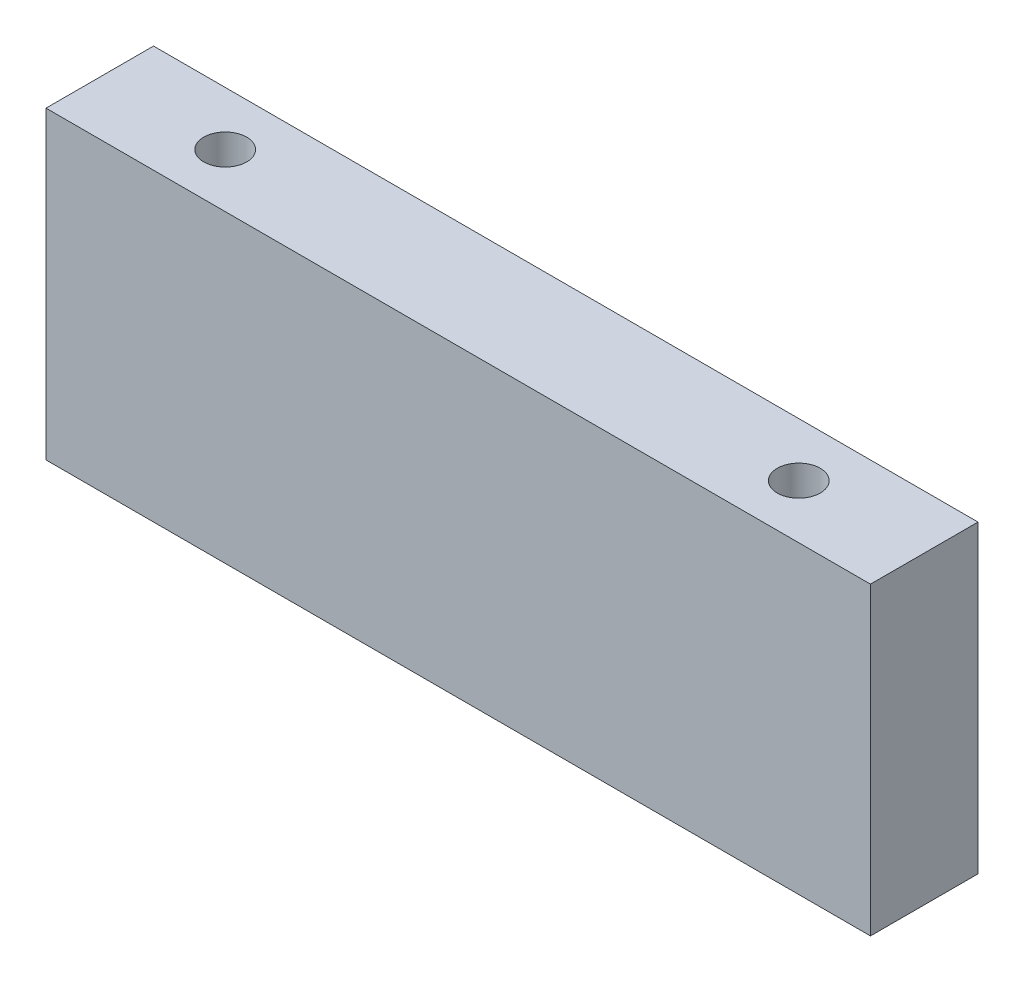
ISO-10303-21;
HEADER;
FILE_DESCRIPTION(('STEP AP214'),'2;1');
FILE_NAME('part.step','',(''),(''),'','','');
FILE_SCHEMA(('AUTOMOTIVE_DESIGN { 1 0 10303 214 1 1 1 1 }'));
ENDSEC;
DATA;
#1=APPLICATION_CONTEXT('core data for automotive mechanical design processes');
#2=APPLICATION_PROTOCOL_DEFINITION('international standard','automotive_design',2000,#1);
#3=PRODUCT_CONTEXT('',#1,'mechanical');
#4=PRODUCT('Part','Part','',(#3));
#5=PRODUCT_RELATED_PRODUCT_CATEGORY('part','',(#4));
#6=PRODUCT_DEFINITION_FORMATION('','',#4);
#7=PRODUCT_DEFINITION_CONTEXT('part definition',#1,'design');
#8=PRODUCT_DEFINITION('design','',#6,#7);
#9=PRODUCT_DEFINITION_SHAPE('','',#8);
#10=(LENGTH_UNIT() NAMED_UNIT(*) SI_UNIT(.MILLI.,.METRE.));
#11=(NAMED_UNIT(*) PLANE_ANGLE_UNIT() SI_UNIT($,.RADIAN.));
#12=(NAMED_UNIT(*) SI_UNIT($,.STERADIAN.) SOLID_ANGLE_UNIT());
#13=UNCERTAINTY_MEASURE_WITH_UNIT(LENGTH_MEASURE(1.E-05),#10,'distance_accuracy_value','');
#14=(GEOMETRIC_REPRESENTATION_CONTEXT(3) GLOBAL_UNCERTAINTY_ASSIGNED_CONTEXT((#13)) GLOBAL_UNIT_ASSIGNED_CONTEXT((#10,
#11,#12)) REPRESENTATION_CONTEXT('',''));
#15=CARTESIAN_POINT('',(0.,0.,0.));
#16=DIRECTION('',(0.,0.,1.));
#17=DIRECTION('',(1.,0.,0.));
#18=AXIS2_PLACEMENT_3D('',#15,#16,#17);
#19=CARTESIAN_POINT('',(57.5,42.5,7.5));
#20=DIRECTION('',(-1.,0.,0.));
#21=DIRECTION('',(0.,0.,1.));
#22=AXIS2_PLACEMENT_3D('',#19,#20,#21);
#23=PLANE('',#22);
#24=DIRECTION('',(0.,0.,-1.));
#25=VECTOR('',#24,1.);
#26=CARTESIAN_POINT('',(57.5,0.,7.5));
#27=LINE('',#26,#25);
#28=CARTESIAN_POINT('',(57.5,0.,7.5));
#29=VERTEX_POINT('',#28);
#30=CARTESIAN_POINT('',(57.5,0.,-7.5));
#31=VERTEX_POINT('',#30);
#32=EDGE_CURVE('E97',#29,#31,#27,.T.);
#33=ORIENTED_EDGE('',*,*,#32,.T.);
#34=DIRECTION('',(0.,-1.,0.));
#35=VECTOR('',#34,1.);
#36=CARTESIAN_POINT('',(57.5,42.5,-7.5));
#37=LINE('',#36,#35);
#38=CARTESIAN_POINT('',(57.5,42.5,-7.5));
#39=VERTEX_POINT('',#38);
#40=EDGE_CURVE('E11',#39,#31,#37,.T.);
#41=ORIENTED_EDGE('',*,*,#40,.F.);
#42=DIRECTION('',(0.,0.,-1.));
#43=VECTOR('',#42,1.);
#44=CARTESIAN_POINT('',(57.5,42.5,7.5));
#45=LINE('',#44,#43);
#46=CARTESIAN_POINT('',(57.5,42.5,7.5));
#47=VERTEX_POINT('',#46);
#48=EDGE_CURVE('E85',#47,#39,#45,.T.);
#49=ORIENTED_EDGE('',*,*,#48,.F.);
#50=DIRECTION('',(0.,-1.,0.));
#51=VECTOR('',#50,1.);
#52=CARTESIAN_POINT('',(57.5,42.5,7.5));
#53=LINE('',#52,#51);
#54=EDGE_CURVE('E93',#47,#29,#53,.T.);
#55=ORIENTED_EDGE('',*,*,#54,.T.);
#56=EDGE_LOOP('',(#33,#41,#49,#55));
#57=FACE_BOUND('',#56,.T.);
#58=ADVANCED_FACE('F34',(#57),#23,.F.);
#59=CARTESIAN_POINT('',(-57.5,42.5,-7.5));
#60=DIRECTION('',(0.,0.,1.));
#61=DIRECTION('',(1.,0.,0.));
#62=AXIS2_PLACEMENT_3D('',#59,#60,#61);
#63=PLANE('',#62);
#64=DIRECTION('',(-1.,0.,0.));
#65=VECTOR('',#64,1.);
#66=CARTESIAN_POINT('',(-57.5,0.,-7.5));
#67=LINE('',#66,#65);
#68=CARTESIAN_POINT('',(-57.5,0.,-7.5));
#69=VERTEX_POINT('',#68);
#70=EDGE_CURVE('E89',#31,#69,#67,.T.);
#71=ORIENTED_EDGE('',*,*,#70,.T.);
#72=DIRECTION('',(0.,-1.,0.));
#73=VECTOR('',#72,1.);
#74=CARTESIAN_POINT('',(-57.5,42.5,-7.5));
#75=LINE('',#74,#73);
#76=CARTESIAN_POINT('',(-57.5,42.5,-7.5));
#77=VERTEX_POINT('',#76);
#78=EDGE_CURVE('E42',#77,#69,#75,.T.);
#79=ORIENTED_EDGE('',*,*,#78,.F.);
#80=DIRECTION('',(-1.,0.,0.));
#81=VECTOR('',#80,1.);
#82=CARTESIAN_POINT('',(-57.5,42.5,-7.5));
#83=LINE('',#82,#81);
#84=EDGE_CURVE('E80',#39,#77,#83,.T.);
#85=ORIENTED_EDGE('',*,*,#84,.F.);
#86=ORIENTED_EDGE('',*,*,#40,.T.);
#87=EDGE_LOOP('',(#71,#79,#85,#86));
#88=FACE_BOUND('',#87,.T.);
#89=ADVANCED_FACE('F88',(#88),#63,.F.);
#90=CARTESIAN_POINT('',(-57.5,42.5,7.5));
#91=DIRECTION('',(1.,0.,0.));
#92=DIRECTION('',(0.,0.,-1.));
#93=AXIS2_PLACEMENT_3D('',#90,#91,#92);
#94=PLANE('',#93);
#95=DIRECTION('',(0.,0.,1.));
#96=VECTOR('',#95,1.);
#97=CARTESIAN_POINT('',(-57.5,0.,7.5));
#98=LINE('',#97,#96);
#99=CARTESIAN_POINT('',(-57.5,0.,7.5));
#100=VERTEX_POINT('',#99);
#101=EDGE_CURVE('E67',#69,#100,#98,.T.);
#102=ORIENTED_EDGE('',*,*,#101,.T.);
#103=DIRECTION('',(0.,-1.,0.));
#104=VECTOR('',#103,1.);
#105=CARTESIAN_POINT('',(-57.5,42.5,7.5));
#106=LINE('',#105,#104);
#107=CARTESIAN_POINT('',(-57.5,42.5,7.5));
#108=VERTEX_POINT('',#107);
#109=EDGE_CURVE('E90',#108,#100,#106,.T.);
#110=ORIENTED_EDGE('',*,*,#109,.F.);
#111=DIRECTION('',(0.,0.,1.));
#112=VECTOR('',#111,1.);
#113=CARTESIAN_POINT('',(-57.5,42.5,7.5));
#114=LINE('',#113,#112);
#115=EDGE_CURVE('E83',#77,#108,#114,.T.);
#116=ORIENTED_EDGE('',*,*,#115,.F.);
#117=ORIENTED_EDGE('',*,*,#78,.T.);
#118=EDGE_LOOP('',(#102,#110,#116,#117));
#119=FACE_BOUND('',#118,.T.);
#120=ADVANCED_FACE('F91',(#119),#94,.F.);
#121=CARTESIAN_POINT('',(-57.5,42.5,7.5));
#122=DIRECTION('',(0.,0.,-1.));
#123=DIRECTION('',(-1.,0.,0.));
#124=AXIS2_PLACEMENT_3D('',#121,#122,#123);
#125=PLANE('',#124);
#126=DIRECTION('',(1.,0.,0.));
#127=VECTOR('',#126,1.);
#128=CARTESIAN_POINT('',(-57.5,0.,7.5));
#129=LINE('',#128,#127);
#130=EDGE_CURVE('E73',#100,#29,#129,.T.);
#131=ORIENTED_EDGE('',*,*,#130,.T.);
#132=ORIENTED_EDGE('',*,*,#54,.F.);
#133=DIRECTION('',(1.,0.,0.));
#134=VECTOR('',#133,1.);
#135=CARTESIAN_POINT('',(-57.5,42.5,7.5));
#136=LINE('',#135,#134);
#137=EDGE_CURVE('E50',#108,#47,#136,.T.);
#138=ORIENTED_EDGE('',*,*,#137,.F.);
#139=ORIENTED_EDGE('',*,*,#109,.T.);
#140=EDGE_LOOP('',(#131,#132,#138,#139));
#141=FACE_BOUND('',#140,.T.);
#142=ADVANCED_FACE('F105',(#141),#125,.F.);
#143=CARTESIAN_POINT('',(0.,42.5,0.));
#144=DIRECTION('',(0.,-1.,0.));
#145=DIRECTION('',(0.,0.,-1.));
#146=AXIS2_PLACEMENT_3D('',#143,#144,#145);
#147=PLANE('',#146);
#148=CARTESIAN_POINT('',(-40.,42.5,0.));
#149=DIRECTION('',(0.,1.,0.));
#150=DIRECTION('',(0.,0.,1.));
#151=AXIS2_PLACEMENT_3D('',#148,#149,#150);
#152=CIRCLE('',#151,3.);
#153=CARTESIAN_POINT('',(-40.,42.5,3.));
#154=VERTEX_POINT('',#153);
#155=EDGE_CURVE('E117',#154,#154,#152,.T.);
#156=ORIENTED_EDGE('',*,*,#155,.F.);
#157=EDGE_LOOP('',(#156));
#158=FACE_BOUND('',#157,.T.);
#159=CARTESIAN_POINT('',(40.,42.5,0.));
#160=DIRECTION('',(0.,1.,0.));
#161=DIRECTION('',(0.,0.,1.));
#162=AXIS2_PLACEMENT_3D('',#159,#160,#161);
#163=CIRCLE('',#162,3.);
#164=CARTESIAN_POINT('',(40.,42.5,2.99999999999999));
#165=VERTEX_POINT('',#164);
#166=EDGE_CURVE('E111',#165,#165,#163,.T.);
#167=ORIENTED_EDGE('',*,*,#166,.F.);
#168=EDGE_LOOP('',(#167));
#169=FACE_BOUND('',#168,.T.);
#170=ORIENTED_EDGE('',*,*,#48,.T.);
#171=ORIENTED_EDGE('',*,*,#84,.T.);
#172=ORIENTED_EDGE('',*,*,#115,.T.);
#173=ORIENTED_EDGE('',*,*,#137,.T.);
#174=EDGE_LOOP('',(#170,#171,#172,#173));
#175=FACE_BOUND('',#174,.T.);
#176=ADVANCED_FACE('F81',(#158,#169,#175),#147,.F.);
#177=CARTESIAN_POINT('',(0.,0.,0.));
#178=DIRECTION('',(0.,-1.,0.));
#179=DIRECTION('',(0.,0.,-1.));
#180=AXIS2_PLACEMENT_3D('',#177,#178,#179);
#181=PLANE('',#180);
#182=CARTESIAN_POINT('',(-40.,0.,0.));
#183=DIRECTION('',(0.,1.,0.));
#184=DIRECTION('',(0.,0.,1.));
#185=AXIS2_PLACEMENT_3D('',#182,#183,#184);
#186=CIRCLE('',#185,3.);
#187=CARTESIAN_POINT('',(-40.,0.,3.));
#188=VERTEX_POINT('',#187);
#189=EDGE_CURVE('E100',#188,#188,#186,.T.);
#190=ORIENTED_EDGE('',*,*,#189,.T.);
#191=EDGE_LOOP('',(#190));
#192=FACE_BOUND('',#191,.T.);
#193=CARTESIAN_POINT('',(40.,0.,0.));
#194=DIRECTION('',(0.,1.,0.));
#195=DIRECTION('',(0.,0.,1.));
#196=AXIS2_PLACEMENT_3D('',#193,#194,#195);
#197=CIRCLE('',#196,3.);
#198=CARTESIAN_POINT('',(40.,0.,2.99999999999999));
#199=VERTEX_POINT('',#198);
#200=EDGE_CURVE('E114',#199,#199,#197,.T.);
#201=ORIENTED_EDGE('',*,*,#200,.T.);
#202=EDGE_LOOP('',(#201));
#203=FACE_BOUND('',#202,.T.);
#204=ORIENTED_EDGE('',*,*,#32,.F.);
#205=ORIENTED_EDGE('',*,*,#130,.F.);
#206=ORIENTED_EDGE('',*,*,#101,.F.);
#207=ORIENTED_EDGE('',*,*,#70,.F.);
#208=EDGE_LOOP('',(#204,#205,#206,#207));
#209=FACE_BOUND('',#208,.T.);
#210=ADVANCED_FACE('F108',(#192,#203,#209),#181,.T.);
#211=CARTESIAN_POINT('',(40.,0.,0.));
#212=DIRECTION('',(0.,1.,0.));
#213=DIRECTION('',(0.,0.,1.));
#214=AXIS2_PLACEMENT_3D('',#211,#212,#213);
#215=CYLINDRICAL_SURFACE('',#214,3.);
#216=ORIENTED_EDGE('',*,*,#200,.F.);
#217=EDGE_LOOP('',(#216));
#218=FACE_BOUND('',#217,.T.);
#219=ORIENTED_EDGE('',*,*,#166,.T.);
#220=EDGE_LOOP('',(#219));
#221=FACE_BOUND('',#220,.T.);
#222=ADVANCED_FACE('F128',(#218,#221),#215,.F.);
#223=CARTESIAN_POINT('',(-40.,0.,0.));
#224=DIRECTION('',(0.,1.,0.));
#225=DIRECTION('',(0.,0.,1.));
#226=AXIS2_PLACEMENT_3D('',#223,#224,#225);
#227=CYLINDRICAL_SURFACE('',#226,3.);
#228=ORIENTED_EDGE('',*,*,#189,.F.);
#229=EDGE_LOOP('',(#228));
#230=FACE_BOUND('',#229,.T.);
#231=ORIENTED_EDGE('',*,*,#155,.T.);
#232=EDGE_LOOP('',(#231));
#233=FACE_BOUND('',#232,.T.);
#234=ADVANCED_FACE('F125',(#230,#233),#227,.F.);
#235=CLOSED_SHELL('',(#58,#89,#120,#142,#176,#210,#222,#234));
#236=MANIFOLD_SOLID_BREP('B2',#235);
#237=ADVANCED_BREP_SHAPE_REPRESENTATION('',(#18,#236),#14);
#238=SHAPE_DEFINITION_REPRESENTATION(#9,#237);
ENDSEC;
END-ISO-10303-21;
